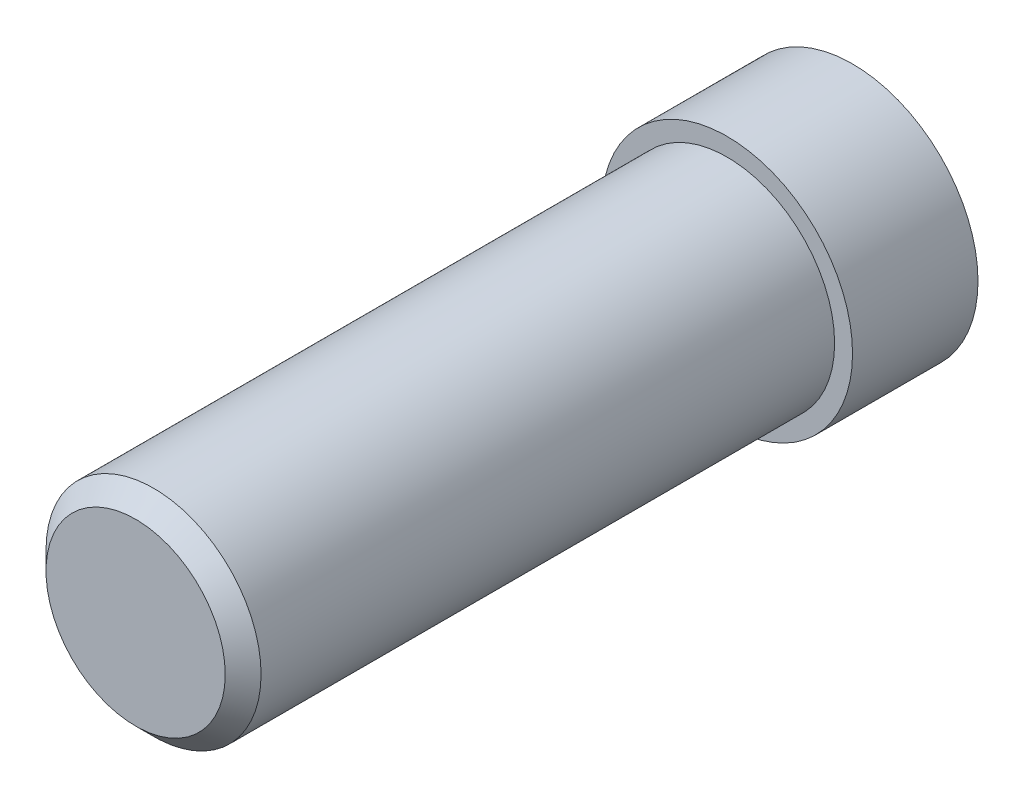
ISO-10303-21;
HEADER;
FILE_DESCRIPTION(('STEP AP214'),'2;1');
FILE_NAME('part.step','',(''),(''),'','','');
FILE_SCHEMA(('AUTOMOTIVE_DESIGN { 1 0 10303 214 1 1 1 1 }'));
ENDSEC;
DATA;
#1=APPLICATION_CONTEXT('core data for automotive mechanical design processes');
#2=APPLICATION_PROTOCOL_DEFINITION('international standard','automotive_design',2000,#1);
#3=PRODUCT_CONTEXT('',#1,'mechanical');
#4=PRODUCT('Part','Part','',(#3));
#5=PRODUCT_RELATED_PRODUCT_CATEGORY('part','',(#4));
#6=PRODUCT_DEFINITION_FORMATION('','',#4);
#7=PRODUCT_DEFINITION_CONTEXT('part definition',#1,'design');
#8=PRODUCT_DEFINITION('design','',#6,#7);
#9=PRODUCT_DEFINITION_SHAPE('','',#8);
#10=(LENGTH_UNIT() NAMED_UNIT(*) SI_UNIT(.MILLI.,.METRE.));
#11=(NAMED_UNIT(*) PLANE_ANGLE_UNIT() SI_UNIT($,.RADIAN.));
#12=(NAMED_UNIT(*) SI_UNIT($,.STERADIAN.) SOLID_ANGLE_UNIT());
#13=UNCERTAINTY_MEASURE_WITH_UNIT(LENGTH_MEASURE(1.E-05),#10,'distance_accuracy_value','');
#14=(GEOMETRIC_REPRESENTATION_CONTEXT(3) GLOBAL_UNCERTAINTY_ASSIGNED_CONTEXT((#13)) GLOBAL_UNIT_ASSIGNED_CONTEXT((#10,
#11,#12)) REPRESENTATION_CONTEXT('',''));
#15=CARTESIAN_POINT('',(0.,0.,0.));
#16=DIRECTION('',(0.,0.,1.));
#17=DIRECTION('',(1.,0.,0.));
#18=AXIS2_PLACEMENT_3D('',#15,#16,#17);
#19=CARTESIAN_POINT('',(0.,0.,7.));
#20=DIRECTION('',(0.,0.,-1.));
#21=DIRECTION('',(-1.,0.,0.));
#22=AXIS2_PLACEMENT_3D('',#19,#20,#21);
#23=CYLINDRICAL_SURFACE('',#22,7.);
#24=CARTESIAN_POINT('',(0.,0.,7.));
#25=DIRECTION('',(0.,0.,1.));
#26=DIRECTION('',(1.,0.,0.));
#27=AXIS2_PLACEMENT_3D('',#24,#25,#26);
#28=CIRCLE('',#27,7.);
#29=CARTESIAN_POINT('',(7.,0.,7.));
#30=VERTEX_POINT('',#29);
#31=EDGE_CURVE('E58',#30,#30,#28,.T.);
#32=ORIENTED_EDGE('',*,*,#31,.F.);
#33=EDGE_LOOP('',(#32));
#34=FACE_BOUND('',#33,.T.);
#35=CARTESIAN_POINT('',(0.,0.,0.));
#36=DIRECTION('',(0.,0.,1.));
#37=DIRECTION('',(1.,0.,0.));
#38=AXIS2_PLACEMENT_3D('',#35,#36,#37);
#39=CIRCLE('',#38,7.);
#40=CARTESIAN_POINT('',(7.,0.,0.));
#41=VERTEX_POINT('',#40);
#42=EDGE_CURVE('E61',#41,#41,#39,.T.);
#43=ORIENTED_EDGE('',*,*,#42,.T.);
#44=EDGE_LOOP('',(#43));
#45=FACE_BOUND('',#44,.T.);
#46=ADVANCED_FACE('F39',(#34,#45),#23,.T.);
#47=CARTESIAN_POINT('',(0.,0.,7.));
#48=DIRECTION('',(0.,0.,1.));
#49=DIRECTION('',(1.,0.,0.));
#50=AXIS2_PLACEMENT_3D('',#47,#48,#49);
#51=PLANE('',#50);
#52=CARTESIAN_POINT('',(0.,0.,7.));
#53=DIRECTION('',(0.,0.,1.));
#54=DIRECTION('',(1.,0.,0.));
#55=AXIS2_PLACEMENT_3D('',#52,#53,#54);
#56=CIRCLE('',#55,6.);
#57=CARTESIAN_POINT('',(6.,0.,7.));
#58=VERTEX_POINT('',#57);
#59=EDGE_CURVE('E53',#58,#58,#56,.T.);
#60=ORIENTED_EDGE('',*,*,#59,.F.);
#61=EDGE_LOOP('',(#60));
#62=FACE_BOUND('',#61,.T.);
#63=ORIENTED_EDGE('',*,*,#31,.T.);
#64=EDGE_LOOP('',(#63));
#65=FACE_BOUND('',#64,.T.);
#66=ADVANCED_FACE('F69',(#62,#65),#51,.T.);
#67=CARTESIAN_POINT('',(0.,0.,0.));
#68=DIRECTION('',(0.,0.,1.));
#69=DIRECTION('',(1.,0.,0.));
#70=AXIS2_PLACEMENT_3D('',#67,#68,#69);
#71=PLANE('',#70);
#72=ORIENTED_EDGE('',*,*,#42,.F.);
#73=EDGE_LOOP('',(#72));
#74=FACE_BOUND('',#73,.T.);
#75=ADVANCED_FACE('F75',(#74),#71,.F.);
#76=CARTESIAN_POINT('',(0.,0.,40.));
#77=DIRECTION('',(0.,0.,-1.));
#78=DIRECTION('',(-1.,0.,0.));
#79=AXIS2_PLACEMENT_3D('',#76,#77,#78);
#80=CYLINDRICAL_SURFACE('',#79,6.);
#81=CARTESIAN_POINT('',(0.,0.,39.));
#82=DIRECTION('',(0.,0.,1.));
#83=DIRECTION('',(1.,0.,0.));
#84=AXIS2_PLACEMENT_3D('',#81,#82,#83);
#85=CIRCLE('',#84,6.);
#86=CARTESIAN_POINT('',(6.,0.,39.));
#87=VERTEX_POINT('',#86);
#88=EDGE_CURVE('E10',#87,#87,#85,.F.);
#89=ORIENTED_EDGE('',*,*,#88,.T.);
#90=EDGE_LOOP('',(#89));
#91=FACE_BOUND('',#90,.T.);
#92=ORIENTED_EDGE('',*,*,#59,.T.);
#93=EDGE_LOOP('',(#92));
#94=FACE_BOUND('',#93,.T.);
#95=ADVANCED_FACE('F77',(#91,#94),#80,.T.);
#96=CARTESIAN_POINT('',(0.,0.,40.));
#97=DIRECTION('',(0.,0.,1.));
#98=DIRECTION('',(1.,0.,0.));
#99=AXIS2_PLACEMENT_3D('',#96,#97,#98);
#100=PLANE('',#99);
#101=CARTESIAN_POINT('',(0.,0.,40.));
#102=DIRECTION('',(0.,0.,1.));
#103=DIRECTION('',(1.,0.,0.));
#104=AXIS2_PLACEMENT_3D('',#101,#102,#103);
#105=CIRCLE('',#104,5.);
#106=CARTESIAN_POINT('',(5.,0.,40.));
#107=VERTEX_POINT('',#106);
#108=EDGE_CURVE('E48',#107,#107,#105,.T.);
#109=ORIENTED_EDGE('',*,*,#108,.T.);
#110=EDGE_LOOP('',(#109));
#111=FACE_BOUND('',#110,.T.);
#112=ADVANCED_FACE('F83',(#111),#100,.T.);
#113=CARTESIAN_POINT('',(0.,0.,40.));
#114=DIRECTION('',(0.,0.,-1.));
#115=DIRECTION('',(-1.,0.,0.));
#116=AXIS2_PLACEMENT_3D('',#113,#114,#115);
#117=CONICAL_SURFACE('',#116,5.,0.785398163397446);
#118=ORIENTED_EDGE('',*,*,#88,.F.);
#119=EDGE_LOOP('',(#118));
#120=FACE_BOUND('',#119,.T.);
#121=ORIENTED_EDGE('',*,*,#108,.F.);
#122=EDGE_LOOP('',(#121));
#123=FACE_BOUND('',#122,.T.);
#124=ADVANCED_FACE('F42',(#120,#123),#117,.T.);
#125=CLOSED_SHELL('',(#46,#66,#75,#95,#112,#124));
#126=MANIFOLD_SOLID_BREP('B2',#125);
#127=ADVANCED_BREP_SHAPE_REPRESENTATION('',(#18,#126),#14);
#128=SHAPE_DEFINITION_REPRESENTATION(#9,#127);
ENDSEC;
END-ISO-10303-21;
